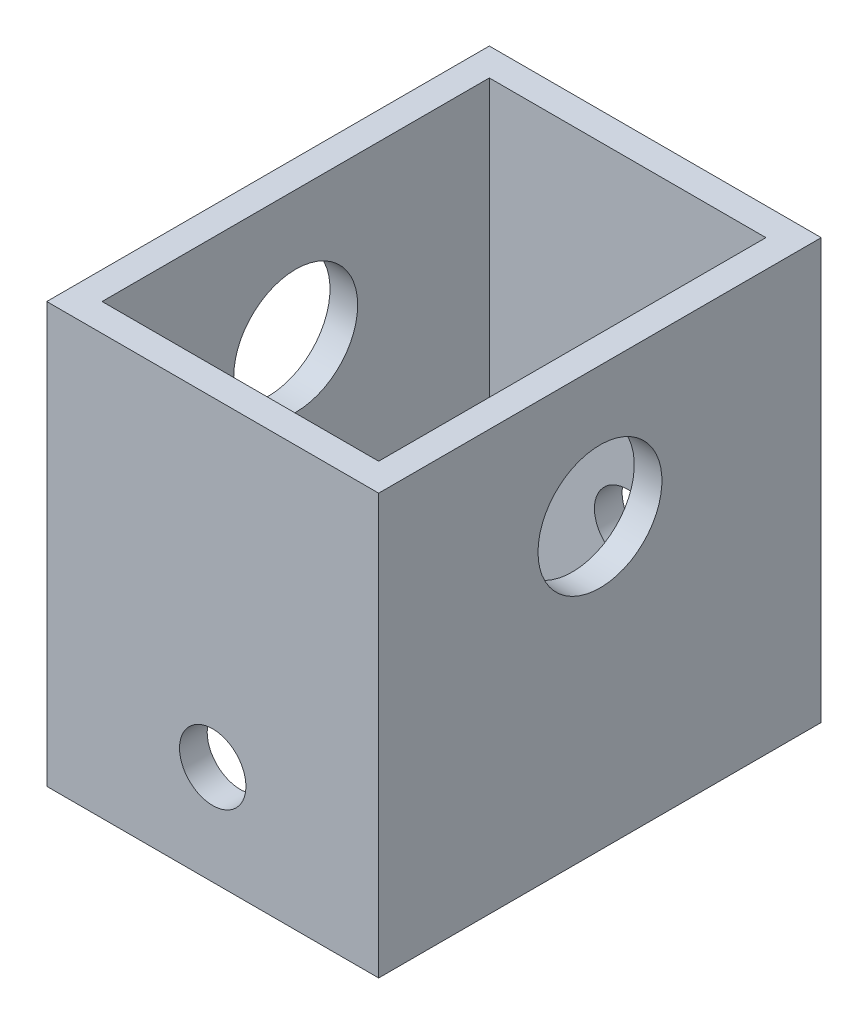
ISO-10303-21;
HEADER;
FILE_DESCRIPTION(('STEP AP214'),'2;1');
FILE_NAME('part.step','',(''),(''),'','','');
FILE_SCHEMA(('AUTOMOTIVE_DESIGN { 1 0 10303 214 1 1 1 1 }'));
ENDSEC;
DATA;
#1=APPLICATION_CONTEXT('core data for automotive mechanical design processes');
#2=APPLICATION_PROTOCOL_DEFINITION('international standard','automotive_design',2000,#1);
#3=PRODUCT_CONTEXT('',#1,'mechanical');
#4=PRODUCT('Part','Part','',(#3));
#5=PRODUCT_RELATED_PRODUCT_CATEGORY('part','',(#4));
#6=PRODUCT_DEFINITION_FORMATION('','',#4);
#7=PRODUCT_DEFINITION_CONTEXT('part definition',#1,'design');
#8=PRODUCT_DEFINITION('design','',#6,#7);
#9=PRODUCT_DEFINITION_SHAPE('','',#8);
#10=(LENGTH_UNIT() NAMED_UNIT(*) SI_UNIT(.MILLI.,.METRE.));
#11=(NAMED_UNIT(*) PLANE_ANGLE_UNIT() SI_UNIT($,.RADIAN.));
#12=(NAMED_UNIT(*) SI_UNIT($,.STERADIAN.) SOLID_ANGLE_UNIT());
#13=UNCERTAINTY_MEASURE_WITH_UNIT(LENGTH_MEASURE(1.E-05),#10,'distance_accuracy_value','');
#14=(GEOMETRIC_REPRESENTATION_CONTEXT(3) GLOBAL_UNCERTAINTY_ASSIGNED_CONTEXT((#13)) GLOBAL_UNIT_ASSIGNED_CONTEXT((#10,
#11,#12)) REPRESENTATION_CONTEXT('',''));
#15=CARTESIAN_POINT('',(0.,0.,0.));
#16=DIRECTION('',(0.,0.,1.));
#17=DIRECTION('',(1.,0.,0.));
#18=AXIS2_PLACEMENT_3D('',#15,#16,#17);
#19=CARTESIAN_POINT('',(0.,96.393,0.));
#20=DIRECTION('',(0.,1.,0.));
#21=DIRECTION('',(0.,0.,1.));
#22=AXIS2_PLACEMENT_3D('',#19,#20,#21);
#23=PLANE('',#22);
#24=DIRECTION('',(0.,0.,-1.));
#25=VECTOR('',#24,1.);
#26=CARTESIAN_POINT('',(38.1,96.393,-50.8));
#27=LINE('',#26,#25);
#28=CARTESIAN_POINT('',(38.1,96.393,50.8));
#29=VERTEX_POINT('',#28);
#30=CARTESIAN_POINT('',(38.1,96.393,-50.8));
#31=VERTEX_POINT('',#30);
#32=EDGE_CURVE('E170',#29,#31,#27,.T.);
#33=ORIENTED_EDGE('',*,*,#32,.T.);
#34=DIRECTION('',(-1.,0.,0.));
#35=VECTOR('',#34,1.);
#36=CARTESIAN_POINT('',(-38.1,96.393,-50.8));
#37=LINE('',#36,#35);
#38=CARTESIAN_POINT('',(-38.1,96.393,-50.8));
#39=VERTEX_POINT('',#38);
#40=EDGE_CURVE('E173',#31,#39,#37,.T.);
#41=ORIENTED_EDGE('',*,*,#40,.T.);
#42=DIRECTION('',(0.,0.,1.));
#43=VECTOR('',#42,1.);
#44=CARTESIAN_POINT('',(-38.1,96.393,-50.8));
#45=LINE('',#44,#43);
#46=CARTESIAN_POINT('',(-38.1,96.393,50.8));
#47=VERTEX_POINT('',#46);
#48=EDGE_CURVE('E176',#39,#47,#45,.T.);
#49=ORIENTED_EDGE('',*,*,#48,.T.);
#50=DIRECTION('',(1.,0.,0.));
#51=VECTOR('',#50,1.);
#52=CARTESIAN_POINT('',(-38.1,96.393,50.8));
#53=LINE('',#52,#51);
#54=EDGE_CURVE('E178',#47,#29,#53,.T.);
#55=ORIENTED_EDGE('',*,*,#54,.T.);
#56=EDGE_LOOP('',(#33,#41,#49,#55));
#57=FACE_BOUND('',#56,.T.);
#58=DIRECTION('',(-1.,0.,0.));
#59=VECTOR('',#58,1.);
#60=CARTESIAN_POINT('',(-38.1,96.393,-44.45));
#61=LINE('',#60,#59);
#62=CARTESIAN_POINT('',(31.75,96.393,-44.45));
#63=VERTEX_POINT('',#62);
#64=CARTESIAN_POINT('',(-31.75,96.393,-44.45));
#65=VERTEX_POINT('',#64);
#66=EDGE_CURVE('E140',#63,#65,#61,.T.);
#67=ORIENTED_EDGE('',*,*,#66,.F.);
#68=DIRECTION('',(0.,0.,-1.));
#69=VECTOR('',#68,1.);
#70=CARTESIAN_POINT('',(31.75,96.393,-50.8));
#71=LINE('',#70,#69);
#72=CARTESIAN_POINT('',(31.75,96.393,44.45));
#73=VERTEX_POINT('',#72);
#74=EDGE_CURVE('E132',#73,#63,#71,.T.);
#75=ORIENTED_EDGE('',*,*,#74,.F.);
#76=DIRECTION('',(1.,0.,0.));
#77=VECTOR('',#76,1.);
#78=CARTESIAN_POINT('',(-38.1,96.393,44.45));
#79=LINE('',#78,#77);
#80=CARTESIAN_POINT('',(-31.75,96.393,44.45));
#81=VERTEX_POINT('',#80);
#82=EDGE_CURVE('E154',#81,#73,#79,.T.);
#83=ORIENTED_EDGE('',*,*,#82,.F.);
#84=DIRECTION('',(0.,0.,1.));
#85=VECTOR('',#84,1.);
#86=CARTESIAN_POINT('',(-31.75,96.393,-50.8));
#87=LINE('',#86,#85);
#88=EDGE_CURVE('E152',#65,#81,#87,.T.);
#89=ORIENTED_EDGE('',*,*,#88,.F.);
#90=EDGE_LOOP('',(#67,#75,#83,#89));
#91=FACE_BOUND('',#90,.T.);
#92=ADVANCED_FACE('F65',(#57,#91),#23,.T.);
#93=CARTESIAN_POINT('',(0.,0.,0.));
#94=DIRECTION('',(0.,1.,0.));
#95=DIRECTION('',(0.,0.,1.));
#96=AXIS2_PLACEMENT_3D('',#93,#94,#95);
#97=PLANE('',#96);
#98=DIRECTION('',(0.,0.,-1.));
#99=VECTOR('',#98,1.);
#100=CARTESIAN_POINT('',(38.1,0.,-50.8));
#101=LINE('',#100,#99);
#102=CARTESIAN_POINT('',(38.1,0.,50.8));
#103=VERTEX_POINT('',#102);
#104=CARTESIAN_POINT('',(38.1,0.,-50.8));
#105=VERTEX_POINT('',#104);
#106=EDGE_CURVE('E148',#103,#105,#101,.T.);
#107=ORIENTED_EDGE('',*,*,#106,.F.);
#108=DIRECTION('',(1.,0.,0.));
#109=VECTOR('',#108,1.);
#110=CARTESIAN_POINT('',(-38.1,0.,50.8));
#111=LINE('',#110,#109);
#112=CARTESIAN_POINT('',(-38.1,0.,50.8));
#113=VERTEX_POINT('',#112);
#114=EDGE_CURVE('E174',#113,#103,#111,.T.);
#115=ORIENTED_EDGE('',*,*,#114,.F.);
#116=DIRECTION('',(0.,0.,1.));
#117=VECTOR('',#116,1.);
#118=CARTESIAN_POINT('',(-38.1,0.,-50.8));
#119=LINE('',#118,#117);
#120=CARTESIAN_POINT('',(-38.1,0.,-50.8));
#121=VERTEX_POINT('',#120);
#122=EDGE_CURVE('E185',#121,#113,#119,.T.);
#123=ORIENTED_EDGE('',*,*,#122,.F.);
#124=DIRECTION('',(-1.,0.,0.));
#125=VECTOR('',#124,1.);
#126=CARTESIAN_POINT('',(-38.1,0.,-50.8));
#127=LINE('',#126,#125);
#128=EDGE_CURVE('E183',#105,#121,#127,.T.);
#129=ORIENTED_EDGE('',*,*,#128,.F.);
#130=EDGE_LOOP('',(#107,#115,#123,#129));
#131=FACE_BOUND('',#130,.T.);
#132=DIRECTION('',(0.,0.,-1.));
#133=VECTOR('',#132,1.);
#134=CARTESIAN_POINT('',(31.75,0.,-50.8));
#135=LINE('',#134,#133);
#136=CARTESIAN_POINT('',(31.75,0.,44.45));
#137=VERTEX_POINT('',#136);
#138=CARTESIAN_POINT('',(31.75,0.,-44.45));
#139=VERTEX_POINT('',#138);
#140=EDGE_CURVE('E90',#137,#139,#135,.T.);
#141=ORIENTED_EDGE('',*,*,#140,.T.);
#142=DIRECTION('',(-1.,0.,0.));
#143=VECTOR('',#142,1.);
#144=CARTESIAN_POINT('',(-38.1,0.,-44.45));
#145=LINE('',#144,#143);
#146=CARTESIAN_POINT('',(-31.75,0.,-44.45));
#147=VERTEX_POINT('',#146);
#148=EDGE_CURVE('E147',#139,#147,#145,.T.);
#149=ORIENTED_EDGE('',*,*,#148,.T.);
#150=DIRECTION('',(0.,0.,1.));
#151=VECTOR('',#150,1.);
#152=CARTESIAN_POINT('',(-31.75,0.,-50.8));
#153=LINE('',#152,#151);
#154=CARTESIAN_POINT('',(-31.75,0.,44.45));
#155=VERTEX_POINT('',#154);
#156=EDGE_CURVE('E162',#147,#155,#153,.T.);
#157=ORIENTED_EDGE('',*,*,#156,.T.);
#158=DIRECTION('',(1.,0.,0.));
#159=VECTOR('',#158,1.);
#160=CARTESIAN_POINT('',(-38.1,0.,44.45));
#161=LINE('',#160,#159);
#162=EDGE_CURVE('E141',#155,#137,#161,.T.);
#163=ORIENTED_EDGE('',*,*,#162,.T.);
#164=EDGE_LOOP('',(#141,#149,#157,#163));
#165=FACE_BOUND('',#164,.T.);
#166=ADVANCED_FACE('F231',(#131,#165),#97,.F.);
#167=CARTESIAN_POINT('',(38.1,96.393,-50.8));
#168=DIRECTION('',(-1.,0.,0.));
#169=DIRECTION('',(0.,0.,1.));
#170=AXIS2_PLACEMENT_3D('',#167,#168,#169);
#171=PLANE('',#170);
#172=CARTESIAN_POINT('',(38.1,66.360000122,0.));
#173=DIRECTION('',(-1.,0.,0.));
#174=DIRECTION('',(0.,0.,1.));
#175=AXIS2_PLACEMENT_3D('',#172,#173,#174);
#176=CIRCLE('',#175,14.224);
#177=CARTESIAN_POINT('',(38.1,66.360000122,14.224));
#178=VERTEX_POINT('',#177);
#179=EDGE_CURVE('E214',#178,#178,#176,.T.);
#180=ORIENTED_EDGE('',*,*,#179,.T.);
#181=EDGE_LOOP('',(#180));
#182=FACE_BOUND('',#181,.T.);
#183=ORIENTED_EDGE('',*,*,#106,.T.);
#184=DIRECTION('',(0.,-1.,0.));
#185=VECTOR('',#184,1.);
#186=CARTESIAN_POINT('',(38.1,96.393,-50.8));
#187=LINE('',#186,#185);
#188=EDGE_CURVE('E12',#31,#105,#187,.T.);
#189=ORIENTED_EDGE('',*,*,#188,.F.);
#190=ORIENTED_EDGE('',*,*,#32,.F.);
#191=DIRECTION('',(0.,-1.,0.));
#192=VECTOR('',#191,1.);
#193=CARTESIAN_POINT('',(38.1,96.393,50.8));
#194=LINE('',#193,#192);
#195=EDGE_CURVE('E180',#29,#103,#194,.T.);
#196=ORIENTED_EDGE('',*,*,#195,.T.);
#197=EDGE_LOOP('',(#183,#189,#190,#196));
#198=FACE_BOUND('',#197,.T.);
#199=ADVANCED_FACE('F67',(#182,#198),#171,.F.);
#200=CARTESIAN_POINT('',(-38.1,96.393,-50.8));
#201=DIRECTION('',(0.,0.,1.));
#202=DIRECTION('',(1.,0.,0.));
#203=AXIS2_PLACEMENT_3D('',#200,#201,#202);
#204=PLANE('',#203);
#205=CARTESIAN_POINT('',(0.,22.86,-50.8));
#206=DIRECTION('',(0.,0.,-1.));
#207=DIRECTION('',(-1.,0.,0.));
#208=AXIS2_PLACEMENT_3D('',#205,#206,#207);
#209=CIRCLE('',#208,7.62);
#210=CARTESIAN_POINT('',(-7.62,22.86,-50.8));
#211=VERTEX_POINT('',#210);
#212=EDGE_CURVE('E201',#211,#211,#209,.T.);
#213=ORIENTED_EDGE('',*,*,#212,.F.);
#214=EDGE_LOOP('',(#213));
#215=FACE_BOUND('',#214,.T.);
#216=ORIENTED_EDGE('',*,*,#128,.T.);
#217=DIRECTION('',(0.,-1.,0.));
#218=VECTOR('',#217,1.);
#219=CARTESIAN_POINT('',(-38.1,96.393,-50.8));
#220=LINE('',#219,#218);
#221=EDGE_CURVE('E74',#39,#121,#220,.T.);
#222=ORIENTED_EDGE('',*,*,#221,.F.);
#223=ORIENTED_EDGE('',*,*,#40,.F.);
#224=ORIENTED_EDGE('',*,*,#188,.T.);
#225=EDGE_LOOP('',(#216,#222,#223,#224));
#226=FACE_BOUND('',#225,.T.);
#227=ADVANCED_FACE('F257',(#215,#226),#204,.F.);
#228=CARTESIAN_POINT('',(-38.1,96.393,-50.8));
#229=DIRECTION('',(1.,0.,0.));
#230=DIRECTION('',(0.,0.,-1.));
#231=AXIS2_PLACEMENT_3D('',#228,#229,#230);
#232=PLANE('',#231);
#233=CARTESIAN_POINT('',(-38.1,66.360000122,0.));
#234=DIRECTION('',(-1.,0.,0.));
#235=DIRECTION('',(0.,0.,1.));
#236=AXIS2_PLACEMENT_3D('',#233,#234,#235);
#237=CIRCLE('',#236,14.224);
#238=CARTESIAN_POINT('',(-38.1,66.360000122,14.224));
#239=VERTEX_POINT('',#238);
#240=EDGE_CURVE('E211',#239,#239,#237,.T.);
#241=ORIENTED_EDGE('',*,*,#240,.F.);
#242=EDGE_LOOP('',(#241));
#243=FACE_BOUND('',#242,.T.);
#244=ORIENTED_EDGE('',*,*,#122,.T.);
#245=DIRECTION('',(0.,-1.,0.));
#246=VECTOR('',#245,1.);
#247=CARTESIAN_POINT('',(-38.1,96.393,50.8));
#248=LINE('',#247,#246);
#249=EDGE_CURVE('E190',#47,#113,#248,.T.);
#250=ORIENTED_EDGE('',*,*,#249,.F.);
#251=ORIENTED_EDGE('',*,*,#48,.F.);
#252=ORIENTED_EDGE('',*,*,#221,.T.);
#253=EDGE_LOOP('',(#244,#250,#251,#252));
#254=FACE_BOUND('',#253,.T.);
#255=ADVANCED_FACE('F255',(#243,#254),#232,.F.);
#256=CARTESIAN_POINT('',(-38.1,96.393,50.8));
#257=DIRECTION('',(0.,0.,-1.));
#258=DIRECTION('',(-1.,0.,0.));
#259=AXIS2_PLACEMENT_3D('',#256,#257,#258);
#260=PLANE('',#259);
#261=CARTESIAN_POINT('',(0.,22.86,50.8));
#262=DIRECTION('',(0.,0.,-1.));
#263=DIRECTION('',(-1.,0.,0.));
#264=AXIS2_PLACEMENT_3D('',#261,#262,#263);
#265=CIRCLE('',#264,7.62);
#266=CARTESIAN_POINT('',(-7.62,22.86,50.8));
#267=VERTEX_POINT('',#266);
#268=EDGE_CURVE('E196',#267,#267,#265,.T.);
#269=ORIENTED_EDGE('',*,*,#268,.T.);
#270=EDGE_LOOP('',(#269));
#271=FACE_BOUND('',#270,.T.);
#272=ORIENTED_EDGE('',*,*,#114,.T.);
#273=ORIENTED_EDGE('',*,*,#195,.F.);
#274=ORIENTED_EDGE('',*,*,#54,.F.);
#275=ORIENTED_EDGE('',*,*,#249,.T.);
#276=EDGE_LOOP('',(#272,#273,#274,#275));
#277=FACE_BOUND('',#276,.T.);
#278=ADVANCED_FACE('F252',(#271,#277),#260,.F.);
#279=CARTESIAN_POINT('',(31.75,96.393,-50.8));
#280=DIRECTION('',(-1.,0.,0.));
#281=DIRECTION('',(0.,0.,1.));
#282=AXIS2_PLACEMENT_3D('',#279,#280,#281);
#283=PLANE('',#282);
#284=CARTESIAN_POINT('',(31.75,66.360000122,0.));
#285=DIRECTION('',(-1.,0.,0.));
#286=DIRECTION('',(0.,0.,1.));
#287=AXIS2_PLACEMENT_3D('',#284,#285,#286);
#288=CIRCLE('',#287,14.224);
#289=CARTESIAN_POINT('',(31.75,66.360000122,14.224));
#290=VERTEX_POINT('',#289);
#291=EDGE_CURVE('E206',#290,#290,#288,.T.);
#292=ORIENTED_EDGE('',*,*,#291,.F.);
#293=EDGE_LOOP('',(#292));
#294=FACE_BOUND('',#293,.T.);
#295=ORIENTED_EDGE('',*,*,#140,.F.);
#296=DIRECTION('',(0.,-1.,0.));
#297=VECTOR('',#296,1.);
#298=CARTESIAN_POINT('',(31.75,96.393,44.45));
#299=LINE('',#298,#297);
#300=EDGE_CURVE('E136',#73,#137,#299,.T.);
#301=ORIENTED_EDGE('',*,*,#300,.F.);
#302=ORIENTED_EDGE('',*,*,#74,.T.);
#303=DIRECTION('',(0.,-1.,0.));
#304=VECTOR('',#303,1.);
#305=CARTESIAN_POINT('',(31.75,96.393,-44.45));
#306=LINE('',#305,#304);
#307=EDGE_CURVE('E135',#63,#139,#306,.T.);
#308=ORIENTED_EDGE('',*,*,#307,.T.);
#309=EDGE_LOOP('',(#295,#301,#302,#308));
#310=FACE_BOUND('',#309,.T.);
#311=ADVANCED_FACE('F134',(#294,#310),#283,.T.);
#312=CARTESIAN_POINT('',(-38.1,96.393,-44.45));
#313=DIRECTION('',(0.,0.,1.));
#314=DIRECTION('',(1.,0.,0.));
#315=AXIS2_PLACEMENT_3D('',#312,#313,#314);
#316=PLANE('',#315);
#317=CARTESIAN_POINT('',(0.,22.86,-44.45));
#318=DIRECTION('',(0.,0.,1.));
#319=DIRECTION('',(1.,0.,0.));
#320=AXIS2_PLACEMENT_3D('',#317,#318,#319);
#321=CIRCLE('',#320,7.62);
#322=CARTESIAN_POINT('',(7.62,22.86,-44.45));
#323=VERTEX_POINT('',#322);
#324=EDGE_CURVE('E160',#323,#323,#321,.T.);
#325=ORIENTED_EDGE('',*,*,#324,.F.);
#326=EDGE_LOOP('',(#325));
#327=FACE_BOUND('',#326,.T.);
#328=ORIENTED_EDGE('',*,*,#148,.F.);
#329=ORIENTED_EDGE('',*,*,#307,.F.);
#330=ORIENTED_EDGE('',*,*,#66,.T.);
#331=DIRECTION('',(0.,-1.,0.));
#332=VECTOR('',#331,1.);
#333=CARTESIAN_POINT('',(-31.75,96.393,-44.45));
#334=LINE('',#333,#332);
#335=EDGE_CURVE('E149',#65,#147,#334,.T.);
#336=ORIENTED_EDGE('',*,*,#335,.T.);
#337=EDGE_LOOP('',(#328,#329,#330,#336));
#338=FACE_BOUND('',#337,.T.);
#339=ADVANCED_FACE('F144',(#327,#338),#316,.T.);
#340=CARTESIAN_POINT('',(-31.75,96.393,-50.8));
#341=DIRECTION('',(1.,0.,0.));
#342=DIRECTION('',(0.,0.,-1.));
#343=AXIS2_PLACEMENT_3D('',#340,#341,#342);
#344=PLANE('',#343);
#345=CARTESIAN_POINT('',(-31.75,66.360000122,0.));
#346=DIRECTION('',(1.,0.,0.));
#347=DIRECTION('',(0.,0.,-1.));
#348=AXIS2_PLACEMENT_3D('',#345,#346,#347);
#349=CIRCLE('',#348,14.224);
#350=CARTESIAN_POINT('',(-31.75,66.360000122,-14.224));
#351=VERTEX_POINT('',#350);
#352=EDGE_CURVE('E69',#351,#351,#349,.T.);
#353=ORIENTED_EDGE('',*,*,#352,.F.);
#354=EDGE_LOOP('',(#353));
#355=FACE_BOUND('',#354,.T.);
#356=ORIENTED_EDGE('',*,*,#156,.F.);
#357=ORIENTED_EDGE('',*,*,#335,.F.);
#358=ORIENTED_EDGE('',*,*,#88,.T.);
#359=DIRECTION('',(0.,-1.,0.));
#360=VECTOR('',#359,1.);
#361=CARTESIAN_POINT('',(-31.75,96.393,44.45));
#362=LINE('',#361,#360);
#363=EDGE_CURVE('E82',#81,#155,#362,.T.);
#364=ORIENTED_EDGE('',*,*,#363,.T.);
#365=EDGE_LOOP('',(#356,#357,#358,#364));
#366=FACE_BOUND('',#365,.T.);
#367=ADVANCED_FACE('F224',(#355,#366),#344,.T.);
#368=CARTESIAN_POINT('',(-38.1,96.393,44.45));
#369=DIRECTION('',(0.,0.,-1.));
#370=DIRECTION('',(-1.,0.,0.));
#371=AXIS2_PLACEMENT_3D('',#368,#369,#370);
#372=PLANE('',#371);
#373=CARTESIAN_POINT('',(0.,22.86,44.45));
#374=DIRECTION('',(0.,0.,-1.));
#375=DIRECTION('',(-1.,0.,0.));
#376=AXIS2_PLACEMENT_3D('',#373,#374,#375);
#377=CIRCLE('',#376,7.62);
#378=CARTESIAN_POINT('',(-7.62,22.86,44.45));
#379=VERTEX_POINT('',#378);
#380=EDGE_CURVE('E194',#379,#379,#377,.T.);
#381=ORIENTED_EDGE('',*,*,#380,.F.);
#382=EDGE_LOOP('',(#381));
#383=FACE_BOUND('',#382,.T.);
#384=ORIENTED_EDGE('',*,*,#162,.F.);
#385=ORIENTED_EDGE('',*,*,#363,.F.);
#386=ORIENTED_EDGE('',*,*,#82,.T.);
#387=ORIENTED_EDGE('',*,*,#300,.T.);
#388=EDGE_LOOP('',(#384,#385,#386,#387));
#389=FACE_BOUND('',#388,.T.);
#390=ADVANCED_FACE('F227',(#383,#389),#372,.T.);
#391=CARTESIAN_POINT('',(0.,22.86,50.8));
#392=DIRECTION('',(0.,0.,-1.));
#393=DIRECTION('',(-1.,0.,0.));
#394=AXIS2_PLACEMENT_3D('',#391,#392,#393);
#395=CYLINDRICAL_SURFACE('',#394,7.62);
#396=ORIENTED_EDGE('',*,*,#380,.T.);
#397=EDGE_LOOP('',(#396));
#398=FACE_BOUND('',#397,.T.);
#399=ORIENTED_EDGE('',*,*,#268,.F.);
#400=EDGE_LOOP('',(#399));
#401=FACE_BOUND('',#400,.T.);
#402=ADVANCED_FACE('F233',(#398,#401),#395,.F.);
#403=ORIENTED_EDGE('',*,*,#324,.T.);
#404=EDGE_LOOP('',(#403));
#405=FACE_BOUND('',#404,.T.);
#406=ORIENTED_EDGE('',*,*,#212,.T.);
#407=EDGE_LOOP('',(#406));
#408=FACE_BOUND('',#407,.T.);
#409=ADVANCED_FACE('F239',(#405,#408),#395,.F.);
#410=CARTESIAN_POINT('',(38.1,66.360000122,0.));
#411=DIRECTION('',(-1.,0.,0.));
#412=DIRECTION('',(0.,0.,1.));
#413=AXIS2_PLACEMENT_3D('',#410,#411,#412);
#414=CYLINDRICAL_SURFACE('',#413,14.224);
#415=ORIENTED_EDGE('',*,*,#352,.T.);
#416=EDGE_LOOP('',(#415));
#417=FACE_BOUND('',#416,.T.);
#418=ORIENTED_EDGE('',*,*,#240,.T.);
#419=EDGE_LOOP('',(#418));
#420=FACE_BOUND('',#419,.T.);
#421=ADVANCED_FACE('F221',(#417,#420),#414,.F.);
#422=ORIENTED_EDGE('',*,*,#291,.T.);
#423=EDGE_LOOP('',(#422));
#424=FACE_BOUND('',#423,.T.);
#425=ORIENTED_EDGE('',*,*,#179,.F.);
#426=EDGE_LOOP('',(#425));
#427=FACE_BOUND('',#426,.T.);
#428=ADVANCED_FACE('F285',(#424,#427),#414,.F.);
#429=CLOSED_SHELL('',(#92,#166,#199,#227,#255,#278,#311,#339,#367,#390,#402,#409,#421,#428));
#430=MANIFOLD_SOLID_BREP('B2',#429);
#431=ADVANCED_BREP_SHAPE_REPRESENTATION('',(#18,#430),#14);
#432=SHAPE_DEFINITION_REPRESENTATION(#9,#431);
ENDSEC;
END-ISO-10303-21;
